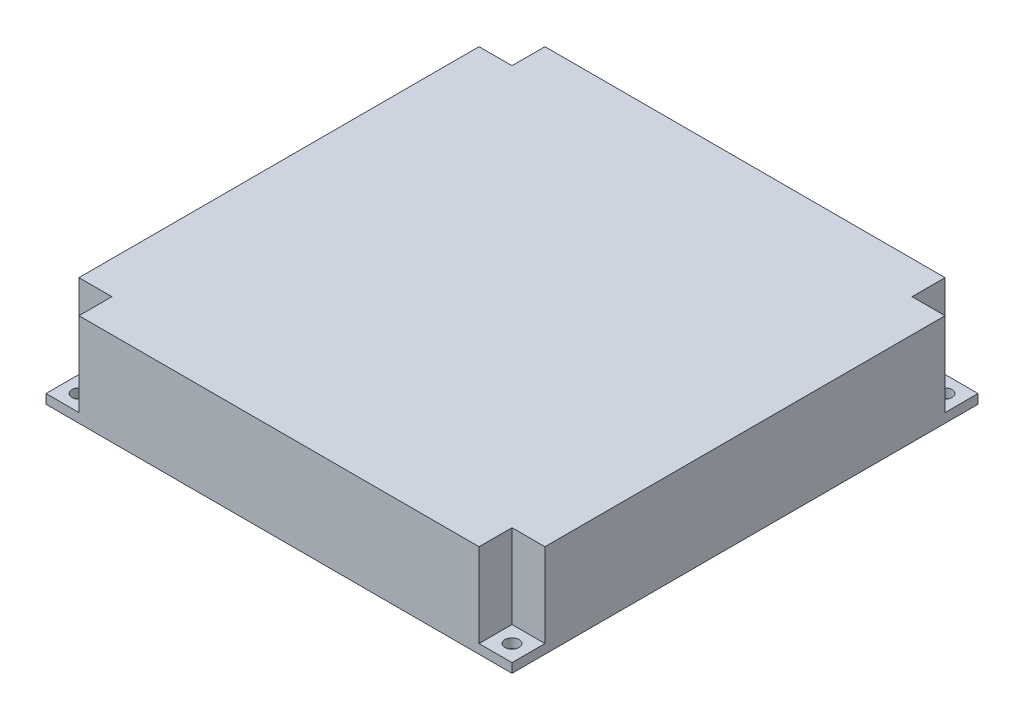
ISO-10303-21;
HEADER;
FILE_DESCRIPTION(('STEP AP214'),'2;1');
FILE_NAME('part.step','',(''),(''),'','','');
FILE_SCHEMA(('AUTOMOTIVE_DESIGN { 1 0 10303 214 1 1 1 1 }'));
ENDSEC;
DATA;
#1=APPLICATION_CONTEXT('core data for automotive mechanical design processes');
#2=APPLICATION_PROTOCOL_DEFINITION('international standard','automotive_design',2000,#1);
#3=PRODUCT_CONTEXT('',#1,'mechanical');
#4=PRODUCT('Part','Part','',(#3));
#5=PRODUCT_RELATED_PRODUCT_CATEGORY('part','',(#4));
#6=PRODUCT_DEFINITION_FORMATION('','',#4);
#7=PRODUCT_DEFINITION_CONTEXT('part definition',#1,'design');
#8=PRODUCT_DEFINITION('design','',#6,#7);
#9=PRODUCT_DEFINITION_SHAPE('','',#8);
#10=(LENGTH_UNIT() NAMED_UNIT(*) SI_UNIT(.MILLI.,.METRE.));
#11=(NAMED_UNIT(*) PLANE_ANGLE_UNIT() SI_UNIT($,.RADIAN.));
#12=(NAMED_UNIT(*) SI_UNIT($,.STERADIAN.) SOLID_ANGLE_UNIT());
#13=UNCERTAINTY_MEASURE_WITH_UNIT(LENGTH_MEASURE(1.E-05),#10,'distance_accuracy_value','');
#14=(GEOMETRIC_REPRESENTATION_CONTEXT(3) GLOBAL_UNCERTAINTY_ASSIGNED_CONTEXT((#13)) GLOBAL_UNIT_ASSIGNED_CONTEXT((#10,
#11,#12)) REPRESENTATION_CONTEXT('',''));
#15=CARTESIAN_POINT('',(0.,0.,0.));
#16=DIRECTION('',(0.,0.,1.));
#17=DIRECTION('',(1.,0.,0.));
#18=AXIS2_PLACEMENT_3D('',#15,#16,#17);
#19=CARTESIAN_POINT('',(-46.4644660940671,-8.,-46.4644660940674));
#20=DIRECTION('',(0.,1.,0.));
#21=DIRECTION('',(0.,0.,1.));
#22=AXIS2_PLACEMENT_3D('',#19,#20,#21);
#23=CYLINDRICAL_SURFACE('',#22,1.5);
#24=CARTESIAN_POINT('',(-46.4644660940671,0.,-46.4644660940674));
#25=DIRECTION('',(0.,1.,0.));
#26=DIRECTION('',(0.,0.,1.));
#27=AXIS2_PLACEMENT_3D('',#24,#25,#26);
#28=CIRCLE('',#27,1.5);
#29=CARTESIAN_POINT('',(-46.4644660940671,0.,-44.9644660940674));
#30=VERTEX_POINT('',#29);
#31=EDGE_CURVE('E391',#30,#30,#28,.T.);
#32=ORIENTED_EDGE('',*,*,#31,.F.);
#33=EDGE_LOOP('',(#32));
#34=FACE_BOUND('',#33,.T.);
#35=CARTESIAN_POINT('',(-46.4644660940671,2.,-46.4644660940674));
#36=DIRECTION('',(0.,1.,0.));
#37=DIRECTION('',(0.,0.,1.));
#38=AXIS2_PLACEMENT_3D('',#35,#36,#37);
#39=CIRCLE('',#38,1.5);
#40=CARTESIAN_POINT('',(-46.4644660940671,2.,-44.9644660940674));
#41=VERTEX_POINT('',#40);
#42=EDGE_CURVE('E403',#41,#41,#39,.F.);
#43=ORIENTED_EDGE('',*,*,#42,.F.);
#44=EDGE_LOOP('',(#43));
#45=FACE_BOUND('',#44,.T.);
#46=ADVANCED_FACE('F42',(#34,#45),#23,.F.);
#47=CARTESIAN_POINT('',(46.4644660940676,-8.,-46.4644660940669));
#48=DIRECTION('',(0.,1.,0.));
#49=DIRECTION('',(0.,0.,1.));
#50=AXIS2_PLACEMENT_3D('',#47,#48,#49);
#51=CYLINDRICAL_SURFACE('',#50,1.50000000000001);
#52=CARTESIAN_POINT('',(46.4644660940676,0.,-46.4644660940669));
#53=DIRECTION('',(0.,1.,0.));
#54=DIRECTION('',(0.,0.,1.));
#55=AXIS2_PLACEMENT_3D('',#52,#53,#54);
#56=CIRCLE('',#55,1.50000000000001);
#57=CARTESIAN_POINT('',(46.4644660940676,0.,-44.9644660940669));
#58=VERTEX_POINT('',#57);
#59=EDGE_CURVE('E394',#58,#58,#56,.T.);
#60=ORIENTED_EDGE('',*,*,#59,.F.);
#61=EDGE_LOOP('',(#60));
#62=FACE_BOUND('',#61,.T.);
#63=CARTESIAN_POINT('',(46.4644660940676,2.,-46.4644660940669));
#64=DIRECTION('',(0.,1.,0.));
#65=DIRECTION('',(0.,0.,1.));
#66=AXIS2_PLACEMENT_3D('',#63,#64,#65);
#67=CIRCLE('',#66,1.50000000000001);
#68=CARTESIAN_POINT('',(46.4644660940676,2.,-44.9644660940669));
#69=VERTEX_POINT('',#68);
#70=EDGE_CURVE('E401',#69,#69,#67,.F.);
#71=ORIENTED_EDGE('',*,*,#70,.F.);
#72=EDGE_LOOP('',(#71));
#73=FACE_BOUND('',#72,.T.);
#74=ADVANCED_FACE('F431',(#62,#73),#51,.F.);
#75=CARTESIAN_POINT('',(46.4644660940668,-8.,46.4644660940677));
#76=DIRECTION('',(0.,1.,0.));
#77=DIRECTION('',(0.,0.,1.));
#78=AXIS2_PLACEMENT_3D('',#75,#76,#77);
#79=CYLINDRICAL_SURFACE('',#78,1.50000000000001);
#80=CARTESIAN_POINT('',(46.4644660940668,0.,46.4644660940677));
#81=DIRECTION('',(0.,1.,0.));
#82=DIRECTION('',(0.,0.,1.));
#83=AXIS2_PLACEMENT_3D('',#80,#81,#82);
#84=CIRCLE('',#83,1.50000000000001);
#85=CARTESIAN_POINT('',(46.4644660940668,0.,47.9644660940677));
#86=VERTEX_POINT('',#85);
#87=EDGE_CURVE('E376',#86,#86,#84,.T.);
#88=ORIENTED_EDGE('',*,*,#87,.F.);
#89=EDGE_LOOP('',(#88));
#90=FACE_BOUND('',#89,.T.);
#91=CARTESIAN_POINT('',(46.4644660940668,2.,46.4644660940677));
#92=DIRECTION('',(0.,1.,0.));
#93=DIRECTION('',(0.,0.,1.));
#94=AXIS2_PLACEMENT_3D('',#91,#92,#93);
#95=CIRCLE('',#94,1.50000000000001);
#96=CARTESIAN_POINT('',(46.4644660940668,2.,47.9644660940677));
#97=VERTEX_POINT('',#96);
#98=EDGE_CURVE('E354',#97,#97,#95,.F.);
#99=ORIENTED_EDGE('',*,*,#98,.F.);
#100=EDGE_LOOP('',(#99));
#101=FACE_BOUND('',#100,.T.);
#102=ADVANCED_FACE('F437',(#90,#101),#79,.F.);
#103=CARTESIAN_POINT('',(50.,20.,-50.));
#104=DIRECTION('',(-1.,0.,0.));
#105=DIRECTION('',(0.,0.,1.));
#106=AXIS2_PLACEMENT_3D('',#103,#104,#105);
#107=PLANE('',#106);
#108=DIRECTION('',(0.,0.,-1.));
#109=VECTOR('',#108,1.);
#110=CARTESIAN_POINT('',(50.,20.,-50.));
#111=LINE('',#110,#109);
#112=CARTESIAN_POINT('',(50.,20.,42.928932188135));
#113=VERTEX_POINT('',#112);
#114=CARTESIAN_POINT('',(50.0000000000003,20.,-42.9289321881342));
#115=VERTEX_POINT('',#114);
#116=EDGE_CURVE('E358',#113,#115,#111,.T.);
#117=ORIENTED_EDGE('',*,*,#116,.F.);
#118=DIRECTION('',(0.,1.,0.));
#119=VECTOR('',#118,1.);
#120=CARTESIAN_POINT('',(49.9999999999996,2.,42.928932188135));
#121=LINE('',#120,#119);
#122=CARTESIAN_POINT('',(49.9999999999996,2.,42.928932188135));
#123=VERTEX_POINT('',#122);
#124=EDGE_CURVE('E316',#123,#113,#121,.T.);
#125=ORIENTED_EDGE('',*,*,#124,.F.);
#126=DIRECTION('',(0.,0.,-1.));
#127=VECTOR('',#126,1.);
#128=CARTESIAN_POINT('',(49.9999999999996,2.,42.928932188135));
#129=LINE('',#128,#127);
#130=CARTESIAN_POINT('',(49.9999999999995,2.,50.0000000000005));
#131=VERTEX_POINT('',#130);
#132=EDGE_CURVE('E325',#131,#123,#129,.T.);
#133=ORIENTED_EDGE('',*,*,#132,.F.);
#134=DIRECTION('',(0.,-1.,0.));
#135=VECTOR('',#134,1.);
#136=CARTESIAN_POINT('',(50.,20.,50.));
#137=LINE('',#136,#135);
#138=CARTESIAN_POINT('',(50.,0.,50.));
#139=VERTEX_POINT('',#138);
#140=EDGE_CURVE('E371',#131,#139,#137,.T.);
#141=ORIENTED_EDGE('',*,*,#140,.T.);
#142=DIRECTION('',(0.,0.,-1.));
#143=VECTOR('',#142,1.);
#144=CARTESIAN_POINT('',(50.,0.,-50.));
#145=LINE('',#144,#143);
#146=CARTESIAN_POINT('',(50.,0.,-50.));
#147=VERTEX_POINT('',#146);
#148=EDGE_CURVE('E372',#139,#147,#145,.T.);
#149=ORIENTED_EDGE('',*,*,#148,.T.);
#150=DIRECTION('',(0.,-1.,0.));
#151=VECTOR('',#150,1.);
#152=CARTESIAN_POINT('',(50.,20.,-50.));
#153=LINE('',#152,#151);
#154=CARTESIAN_POINT('',(50.0000000000003,2.,-49.9999999999997));
#155=VERTEX_POINT('',#154);
#156=EDGE_CURVE('E11',#155,#147,#153,.T.);
#157=ORIENTED_EDGE('',*,*,#156,.F.);
#158=DIRECTION('',(0.,0.,-1.));
#159=VECTOR('',#158,1.);
#160=CARTESIAN_POINT('',(50.0000000000003,2.,-42.9289321881342));
#161=LINE('',#160,#159);
#162=CARTESIAN_POINT('',(50.0000000000003,2.,-42.9289321881342));
#163=VERTEX_POINT('',#162);
#164=EDGE_CURVE('E295',#163,#155,#161,.T.);
#165=ORIENTED_EDGE('',*,*,#164,.F.);
#166=DIRECTION('',(0.,1.,0.));
#167=VECTOR('',#166,1.);
#168=CARTESIAN_POINT('',(50.0000000000003,2.,-42.9289321881342));
#169=LINE('',#168,#167);
#170=EDGE_CURVE('E298',#163,#115,#169,.T.);
#171=ORIENTED_EDGE('',*,*,#170,.T.);
#172=EDGE_LOOP('',(#117,#125,#133,#141,#149,#157,#165,#171));
#173=FACE_BOUND('',#172,.T.);
#174=ADVANCED_FACE('F44',(#173),#107,.F.);
#175=CARTESIAN_POINT('',(-50.,20.,-50.));
#176=DIRECTION('',(0.,0.,1.));
#177=DIRECTION('',(1.,0.,0.));
#178=AXIS2_PLACEMENT_3D('',#175,#176,#177);
#179=PLANE('',#178);
#180=DIRECTION('',(-1.,0.,0.));
#181=VECTOR('',#180,1.);
#182=CARTESIAN_POINT('',(-50.,20.,-50.));
#183=LINE('',#182,#181);
#184=CARTESIAN_POINT('',(42.9289321881348,20.,-50.));
#185=VERTEX_POINT('',#184);
#186=CARTESIAN_POINT('',(-42.9289321881344,20.,-50.0000000000001));
#187=VERTEX_POINT('',#186);
#188=EDGE_CURVE('E361',#185,#187,#183,.T.);
#189=ORIENTED_EDGE('',*,*,#188,.F.);
#190=DIRECTION('',(0.,1.,0.));
#191=VECTOR('',#190,1.);
#192=CARTESIAN_POINT('',(42.9289321881348,2.,-49.9999999999997));
#193=LINE('',#192,#191);
#194=CARTESIAN_POINT('',(42.9289321881348,2.,-49.9999999999997));
#195=VERTEX_POINT('',#194);
#196=EDGE_CURVE('E293',#195,#185,#193,.T.);
#197=ORIENTED_EDGE('',*,*,#196,.F.);
#198=DIRECTION('',(-1.,0.,0.));
#199=VECTOR('',#198,1.);
#200=CARTESIAN_POINT('',(42.9289321881348,2.,-49.9999999999997));
#201=LINE('',#200,#199);
#202=EDGE_CURVE('E304',#155,#195,#201,.T.);
#203=ORIENTED_EDGE('',*,*,#202,.F.);
#204=ORIENTED_EDGE('',*,*,#156,.T.);
#205=DIRECTION('',(-1.,0.,0.));
#206=VECTOR('',#205,1.);
#207=CARTESIAN_POINT('',(-50.,0.,-50.));
#208=LINE('',#207,#206);
#209=CARTESIAN_POINT('',(-50.,0.,-50.));
#210=VERTEX_POINT('',#209);
#211=EDGE_CURVE('E375',#147,#210,#208,.T.);
#212=ORIENTED_EDGE('',*,*,#211,.T.);
#213=DIRECTION('',(0.,-1.,0.));
#214=VECTOR('',#213,1.);
#215=CARTESIAN_POINT('',(-50.,20.,-50.));
#216=LINE('',#215,#214);
#217=CARTESIAN_POINT('',(-49.9999999999999,2.,-50.0000000000002));
#218=VERTEX_POINT('',#217);
#219=EDGE_CURVE('E51',#218,#210,#216,.T.);
#220=ORIENTED_EDGE('',*,*,#219,.F.);
#221=DIRECTION('',(-1.,0.,0.));
#222=VECTOR('',#221,1.);
#223=CARTESIAN_POINT('',(-42.9289321881344,2.,-50.0000000000001));
#224=LINE('',#223,#222);
#225=CARTESIAN_POINT('',(-42.9289321881344,2.,-50.0000000000001));
#226=VERTEX_POINT('',#225);
#227=EDGE_CURVE('E270',#226,#218,#224,.T.);
#228=ORIENTED_EDGE('',*,*,#227,.F.);
#229=DIRECTION('',(0.,1.,0.));
#230=VECTOR('',#229,1.);
#231=CARTESIAN_POINT('',(-42.9289321881344,2.,-50.0000000000001));
#232=LINE('',#231,#230);
#233=EDGE_CURVE('E273',#226,#187,#232,.T.);
#234=ORIENTED_EDGE('',*,*,#233,.T.);
#235=EDGE_LOOP('',(#189,#197,#203,#204,#212,#220,#228,#234));
#236=FACE_BOUND('',#235,.T.);
#237=ADVANCED_FACE('F462',(#236),#179,.F.);
#238=CARTESIAN_POINT('',(-50.,20.,-50.));
#239=DIRECTION('',(1.,0.,0.));
#240=DIRECTION('',(0.,0.,-1.));
#241=AXIS2_PLACEMENT_3D('',#238,#239,#240);
#242=PLANE('',#241);
#243=DIRECTION('',(0.,0.,1.));
#244=VECTOR('',#243,1.);
#245=CARTESIAN_POINT('',(-50.,20.,-50.));
#246=LINE('',#245,#244);
#247=CARTESIAN_POINT('',(-50.,20.,-42.9289321881347));
#248=VERTEX_POINT('',#247);
#249=CARTESIAN_POINT('',(-50.,20.,42.9289321881345));
#250=VERTEX_POINT('',#249);
#251=EDGE_CURVE('E365',#248,#250,#246,.T.);
#252=ORIENTED_EDGE('',*,*,#251,.F.);
#253=DIRECTION('',(0.,1.,0.));
#254=VECTOR('',#253,1.);
#255=CARTESIAN_POINT('',(-49.9999999999999,2.,-42.9289321881347));
#256=LINE('',#255,#254);
#257=CARTESIAN_POINT('',(-49.9999999999999,2.,-42.9289321881347));
#258=VERTEX_POINT('',#257);
#259=EDGE_CURVE('E268',#258,#248,#256,.T.);
#260=ORIENTED_EDGE('',*,*,#259,.F.);
#261=DIRECTION('',(0.,0.,1.));
#262=VECTOR('',#261,1.);
#263=CARTESIAN_POINT('',(-49.9999999999999,2.,-42.9289321881347));
#264=LINE('',#263,#262);
#265=EDGE_CURVE('E280',#218,#258,#264,.T.);
#266=ORIENTED_EDGE('',*,*,#265,.F.);
#267=ORIENTED_EDGE('',*,*,#219,.T.);
#268=DIRECTION('',(0.,0.,1.));
#269=VECTOR('',#268,1.);
#270=CARTESIAN_POINT('',(-50.,0.,-50.));
#271=LINE('',#270,#269);
#272=CARTESIAN_POINT('',(-50.,0.,50.));
#273=VERTEX_POINT('',#272);
#274=EDGE_CURVE('E379',#210,#273,#271,.T.);
#275=ORIENTED_EDGE('',*,*,#274,.T.);
#276=DIRECTION('',(0.,-1.,0.));
#277=VECTOR('',#276,1.);
#278=CARTESIAN_POINT('',(-50.,20.,50.));
#279=LINE('',#278,#277);
#280=CARTESIAN_POINT('',(-50.,2.,50.));
#281=VERTEX_POINT('',#280);
#282=EDGE_CURVE('E385',#281,#273,#279,.T.);
#283=ORIENTED_EDGE('',*,*,#282,.F.);
#284=DIRECTION('',(0.,0.,1.));
#285=VECTOR('',#284,1.);
#286=CARTESIAN_POINT('',(-50.,2.,42.9289321881345));
#287=LINE('',#286,#285);
#288=CARTESIAN_POINT('',(-50.,2.,42.9289321881345));
#289=VERTEX_POINT('',#288);
#290=EDGE_CURVE('E337',#289,#281,#287,.T.);
#291=ORIENTED_EDGE('',*,*,#290,.F.);
#292=DIRECTION('',(0.,1.,0.));
#293=VECTOR('',#292,1.);
#294=CARTESIAN_POINT('',(-50.,2.,42.9289321881345));
#295=LINE('',#294,#293);
#296=EDGE_CURVE('E351',#289,#250,#295,.T.);
#297=ORIENTED_EDGE('',*,*,#296,.T.);
#298=EDGE_LOOP('',(#252,#260,#266,#267,#275,#283,#291,#297));
#299=FACE_BOUND('',#298,.T.);
#300=ADVANCED_FACE('F459',(#299),#242,.F.);
#301=CARTESIAN_POINT('',(-50.,20.,50.));
#302=DIRECTION('',(0.,0.,-1.));
#303=DIRECTION('',(-1.,0.,0.));
#304=AXIS2_PLACEMENT_3D('',#301,#302,#303);
#305=PLANE('',#304);
#306=DIRECTION('',(1.,0.,0.));
#307=VECTOR('',#306,1.);
#308=CARTESIAN_POINT('',(42.928932188134,2.,50.0000000000004));
#309=LINE('',#308,#307);
#310=CARTESIAN_POINT('',(42.928932188134,2.,50.0000000000004));
#311=VERTEX_POINT('',#310);
#312=EDGE_CURVE('E318',#311,#131,#309,.T.);
#313=ORIENTED_EDGE('',*,*,#312,.F.);
#314=DIRECTION('',(0.,1.,0.));
#315=VECTOR('',#314,1.);
#316=CARTESIAN_POINT('',(42.928932188134,2.,50.0000000000004));
#317=LINE('',#316,#315);
#318=CARTESIAN_POINT('',(42.928932188134,20.,50.0000000000004));
#319=VERTEX_POINT('',#318);
#320=EDGE_CURVE('E267',#311,#319,#317,.T.);
#321=ORIENTED_EDGE('',*,*,#320,.T.);
#322=DIRECTION('',(1.,0.,0.));
#323=VECTOR('',#322,1.);
#324=CARTESIAN_POINT('',(-50.,20.,50.));
#325=LINE('',#324,#323);
#326=CARTESIAN_POINT('',(-42.9289321881345,20.,50.));
#327=VERTEX_POINT('',#326);
#328=EDGE_CURVE('E368',#327,#319,#325,.T.);
#329=ORIENTED_EDGE('',*,*,#328,.F.);
#330=DIRECTION('',(0.,1.,0.));
#331=VECTOR('',#330,1.);
#332=CARTESIAN_POINT('',(-42.9289321881345,2.,50.));
#333=LINE('',#332,#331);
#334=CARTESIAN_POINT('',(-42.9289321881345,2.,50.));
#335=VERTEX_POINT('',#334);
#336=EDGE_CURVE('E67',#335,#327,#333,.T.);
#337=ORIENTED_EDGE('',*,*,#336,.F.);
#338=DIRECTION('',(1.,0.,0.));
#339=VECTOR('',#338,1.);
#340=CARTESIAN_POINT('',(-42.9289321881345,2.,50.));
#341=LINE('',#340,#339);
#342=EDGE_CURVE('E339',#281,#335,#341,.T.);
#343=ORIENTED_EDGE('',*,*,#342,.F.);
#344=ORIENTED_EDGE('',*,*,#282,.T.);
#345=DIRECTION('',(1.,0.,0.));
#346=VECTOR('',#345,1.);
#347=CARTESIAN_POINT('',(-50.,0.,50.));
#348=LINE('',#347,#346);
#349=EDGE_CURVE('E362',#273,#139,#348,.T.);
#350=ORIENTED_EDGE('',*,*,#349,.T.);
#351=ORIENTED_EDGE('',*,*,#140,.F.);
#352=EDGE_LOOP('',(#313,#321,#329,#337,#343,#344,#350,#351));
#353=FACE_BOUND('',#352,.T.);
#354=ADVANCED_FACE('F453',(#353),#305,.F.);
#355=CARTESIAN_POINT('',(0.,20.,0.));
#356=DIRECTION('',(0.,1.,0.));
#357=DIRECTION('',(0.,0.,1.));
#358=AXIS2_PLACEMENT_3D('',#355,#356,#357);
#359=PLANE('',#358);
#360=DIRECTION('',(0.,0.,1.));
#361=VECTOR('',#360,1.);
#362=CARTESIAN_POINT('',(42.9289321881341,20.,42.928932188135));
#363=LINE('',#362,#361);
#364=CARTESIAN_POINT('',(42.9289321881341,20.,42.928932188135));
#365=VERTEX_POINT('',#364);
#366=EDGE_CURVE('E323',#365,#319,#363,.T.);
#367=ORIENTED_EDGE('',*,*,#366,.F.);
#368=DIRECTION('',(-1.,0.,0.));
#369=VECTOR('',#368,1.);
#370=CARTESIAN_POINT('',(42.9289321881341,20.,42.928932188135));
#371=LINE('',#370,#369);
#372=EDGE_CURVE('E301',#113,#365,#371,.T.);
#373=ORIENTED_EDGE('',*,*,#372,.F.);
#374=ORIENTED_EDGE('',*,*,#116,.T.);
#375=DIRECTION('',(1.,0.,0.));
#376=VECTOR('',#375,1.);
#377=CARTESIAN_POINT('',(42.9289321881348,20.,-42.9289321881342));
#378=LINE('',#377,#376);
#379=CARTESIAN_POINT('',(42.9289321881348,20.,-42.9289321881342));
#380=VERTEX_POINT('',#379);
#381=EDGE_CURVE('E302',#380,#115,#378,.T.);
#382=ORIENTED_EDGE('',*,*,#381,.F.);
#383=DIRECTION('',(0.,0.,1.));
#384=VECTOR('',#383,1.);
#385=CARTESIAN_POINT('',(42.9289321881348,20.,-42.9289321881342));
#386=LINE('',#385,#384);
#387=EDGE_CURVE('E276',#185,#380,#386,.T.);
#388=ORIENTED_EDGE('',*,*,#387,.F.);
#389=ORIENTED_EDGE('',*,*,#188,.T.);
#390=DIRECTION('',(0.,0.,-1.));
#391=VECTOR('',#390,1.);
#392=CARTESIAN_POINT('',(-42.9289321881344,20.,-42.9289321881347));
#393=LINE('',#392,#391);
#394=CARTESIAN_POINT('',(-42.9289321881344,20.,-42.9289321881347));
#395=VERTEX_POINT('',#394);
#396=EDGE_CURVE('E277',#395,#187,#393,.T.);
#397=ORIENTED_EDGE('',*,*,#396,.F.);
#398=DIRECTION('',(1.,0.,0.));
#399=VECTOR('',#398,1.);
#400=CARTESIAN_POINT('',(-42.9289321881344,20.,-42.9289321881347));
#401=LINE('',#400,#399);
#402=EDGE_CURVE('E279',#248,#395,#401,.T.);
#403=ORIENTED_EDGE('',*,*,#402,.F.);
#404=ORIENTED_EDGE('',*,*,#251,.T.);
#405=DIRECTION('',(-1.,0.,0.));
#406=VECTOR('',#405,1.);
#407=CARTESIAN_POINT('',(-42.9289321881345,20.,42.9289321881345));
#408=LINE('',#407,#406);
#409=CARTESIAN_POINT('',(-42.9289321881345,20.,42.9289321881345));
#410=VERTEX_POINT('',#409);
#411=EDGE_CURVE('E340',#410,#250,#408,.T.);
#412=ORIENTED_EDGE('',*,*,#411,.F.);
#413=DIRECTION('',(0.,0.,-1.));
#414=VECTOR('',#413,1.);
#415=CARTESIAN_POINT('',(-42.9289321881345,20.,42.9289321881345));
#416=LINE('',#415,#414);
#417=EDGE_CURVE('E283',#327,#410,#416,.T.);
#418=ORIENTED_EDGE('',*,*,#417,.F.);
#419=ORIENTED_EDGE('',*,*,#328,.T.);
#420=EDGE_LOOP('',(#367,#373,#374,#382,#388,#389,#397,#403,#404,#412,#418,#419));
#421=FACE_BOUND('',#420,.T.);
#422=ADVANCED_FACE('F450',(#421),#359,.T.);
#423=CARTESIAN_POINT('',(0.,0.,0.));
#424=DIRECTION('',(0.,1.,0.));
#425=DIRECTION('',(0.,0.,1.));
#426=AXIS2_PLACEMENT_3D('',#423,#424,#425);
#427=PLANE('',#426);
#428=DIRECTION('',(0.,0.,1.));
#429=VECTOR('',#428,1.);
#430=CARTESIAN_POINT('',(40.9289321881345,0.,2.81147158996242E-13));
#431=LINE('',#430,#429);
#432=CARTESIAN_POINT('',(40.9289321881348,0.,-48.));
#433=VERTEX_POINT('',#432);
#434=CARTESIAN_POINT('',(40.9289321881348,0.,-40.9289321881342));
#435=VERTEX_POINT('',#434);
#436=EDGE_CURVE('E259',#433,#435,#431,.T.);
#437=ORIENTED_EDGE('',*,*,#436,.F.);
#438=DIRECTION('',(-1.,0.,0.));
#439=VECTOR('',#438,1.);
#440=CARTESIAN_POINT('',(-50.,0.,-48.));
#441=LINE('',#440,#439);
#442=CARTESIAN_POINT('',(-40.9289321881344,0.,-48.));
#443=VERTEX_POINT('',#442);
#444=EDGE_CURVE('E241',#433,#443,#441,.T.);
#445=ORIENTED_EDGE('',*,*,#444,.T.);
#446=DIRECTION('',(0.,0.,-1.));
#447=VECTOR('',#446,1.);
#448=CARTESIAN_POINT('',(-40.9289321881345,0.,-1.20491639569818E-13));
#449=LINE('',#448,#447);
#450=CARTESIAN_POINT('',(-40.9289321881344,0.,-40.9289321881347));
#451=VERTEX_POINT('',#450);
#452=EDGE_CURVE('E250',#451,#443,#449,.T.);
#453=ORIENTED_EDGE('',*,*,#452,.F.);
#454=DIRECTION('',(1.,0.,0.));
#455=VECTOR('',#454,1.);
#456=CARTESIAN_POINT('',(1.20491639569818E-13,0.,-40.9289321881345));
#457=LINE('',#456,#455);
#458=CARTESIAN_POINT('',(-48.,0.,-40.9289321881347));
#459=VERTEX_POINT('',#458);
#460=EDGE_CURVE('E245',#459,#451,#457,.T.);
#461=ORIENTED_EDGE('',*,*,#460,.F.);
#462=DIRECTION('',(0.,0.,1.));
#463=VECTOR('',#462,1.);
#464=CARTESIAN_POINT('',(-48.,0.,-50.));
#465=LINE('',#464,#463);
#466=CARTESIAN_POINT('',(-48.,0.,40.9289321881345));
#467=VERTEX_POINT('',#466);
#468=EDGE_CURVE('E229',#459,#467,#465,.T.);
#469=ORIENTED_EDGE('',*,*,#468,.T.);
#470=DIRECTION('',(-1.,0.,0.));
#471=VECTOR('',#470,1.);
#472=CARTESIAN_POINT('',(-42.9289321881345,0.,40.9289321881345));
#473=LINE('',#472,#471);
#474=CARTESIAN_POINT('',(-40.9289321881345,0.,40.9289321881345));
#475=VERTEX_POINT('',#474);
#476=EDGE_CURVE('E877',#475,#467,#473,.T.);
#477=ORIENTED_EDGE('',*,*,#476,.F.);
#478=DIRECTION('',(0.,0.,-1.));
#479=VECTOR('',#478,1.);
#480=CARTESIAN_POINT('',(-40.9289321881345,0.,42.9289321881345));
#481=LINE('',#480,#479);
#482=CARTESIAN_POINT('',(-40.9289321881345,0.,48.));
#483=VERTEX_POINT('',#482);
#484=EDGE_CURVE('E880',#483,#475,#481,.T.);
#485=ORIENTED_EDGE('',*,*,#484,.F.);
#486=DIRECTION('',(1.,0.,0.));
#487=VECTOR('',#486,1.);
#488=CARTESIAN_POINT('',(-50.,0.,48.));
#489=LINE('',#488,#487);
#490=CARTESIAN_POINT('',(40.928932188134,0.,48.));
#491=VERTEX_POINT('',#490);
#492=EDGE_CURVE('E240',#483,#491,#489,.T.);
#493=ORIENTED_EDGE('',*,*,#492,.T.);
#494=DIRECTION('',(0.,0.,1.));
#495=VECTOR('',#494,1.);
#496=CARTESIAN_POINT('',(40.9289321881345,0.,4.0163879856606E-13));
#497=LINE('',#496,#495);
#498=CARTESIAN_POINT('',(40.9289321881341,0.,40.9289321881349));
#499=VERTEX_POINT('',#498);
#500=EDGE_CURVE('E904',#499,#491,#497,.T.);
#501=ORIENTED_EDGE('',*,*,#500,.F.);
#502=DIRECTION('',(-1.,0.,0.));
#503=VECTOR('',#502,1.);
#504=CARTESIAN_POINT('',(-4.0163879856606E-13,0.,40.9289321881345));
#505=LINE('',#504,#503);
#506=CARTESIAN_POINT('',(48.,0.,40.928932188135));
#507=VERTEX_POINT('',#506);
#508=EDGE_CURVE('E890',#507,#499,#505,.T.);
#509=ORIENTED_EDGE('',*,*,#508,.F.);
#510=DIRECTION('',(0.,0.,-1.));
#511=VECTOR('',#510,1.);
#512=CARTESIAN_POINT('',(48.,0.,-50.));
#513=LINE('',#512,#511);
#514=CARTESIAN_POINT('',(48.,0.,-40.9289321881342));
#515=VERTEX_POINT('',#514);
#516=EDGE_CURVE('E887',#507,#515,#513,.T.);
#517=ORIENTED_EDGE('',*,*,#516,.T.);
#518=DIRECTION('',(1.,0.,0.));
#519=VECTOR('',#518,1.);
#520=CARTESIAN_POINT('',(2.81147158996242E-13,0.,-40.9289321881345));
#521=LINE('',#520,#519);
#522=EDGE_CURVE('E256',#435,#515,#521,.T.);
#523=ORIENTED_EDGE('',*,*,#522,.F.);
#524=EDGE_LOOP('',(#437,#445,#453,#461,#469,#477,#485,#493,#501,#509,#517,#523));
#525=FACE_BOUND('',#524,.T.);
#526=ORIENTED_EDGE('',*,*,#87,.T.);
#527=EDGE_LOOP('',(#526));
#528=FACE_BOUND('',#527,.T.);
#529=ORIENTED_EDGE('',*,*,#59,.T.);
#530=EDGE_LOOP('',(#529));
#531=FACE_BOUND('',#530,.T.);
#532=ORIENTED_EDGE('',*,*,#31,.T.);
#533=EDGE_LOOP('',(#532));
#534=FACE_BOUND('',#533,.T.);
#535=CARTESIAN_POINT('',(-46.4644660940672,0.,46.4644660940673));
#536=DIRECTION('',(0.,1.,0.));
#537=DIRECTION('',(0.,0.,1.));
#538=AXIS2_PLACEMENT_3D('',#535,#536,#537);
#539=CIRCLE('',#538,1.5);
#540=CARTESIAN_POINT('',(-46.4644660940672,0.,47.9644660940673));
#541=VERTEX_POINT('',#540);
#542=EDGE_CURVE('E388',#541,#541,#539,.T.);
#543=ORIENTED_EDGE('',*,*,#542,.T.);
#544=EDGE_LOOP('',(#543));
#545=FACE_BOUND('',#544,.T.);
#546=ORIENTED_EDGE('',*,*,#148,.F.);
#547=ORIENTED_EDGE('',*,*,#349,.F.);
#548=ORIENTED_EDGE('',*,*,#274,.F.);
#549=ORIENTED_EDGE('',*,*,#211,.F.);
#550=EDGE_LOOP('',(#546,#547,#548,#549));
#551=FACE_BOUND('',#550,.T.);
#552=ADVANCED_FACE('F253',(#525,#528,#531,#534,#545,#551),#427,.F.);
#553=CARTESIAN_POINT('',(-46.4644660940672,-8.,46.4644660940673));
#554=DIRECTION('',(0.,1.,0.));
#555=DIRECTION('',(0.,0.,1.));
#556=AXIS2_PLACEMENT_3D('',#553,#554,#555);
#557=CYLINDRICAL_SURFACE('',#556,1.5);
#558=CARTESIAN_POINT('',(-46.4644660940672,2.,46.4644660940673));
#559=DIRECTION('',(0.,-1.,0.));
#560=DIRECTION('',(0.,0.,-1.));
#561=AXIS2_PLACEMENT_3D('',#558,#559,#560);
#562=CIRCLE('',#561,1.5);
#563=CARTESIAN_POINT('',(-46.4644660940672,2.,44.9644660940673));
#564=VERTEX_POINT('',#563);
#565=EDGE_CURVE('E46',#564,#564,#562,.F.);
#566=ORIENTED_EDGE('',*,*,#565,.T.);
#567=EDGE_LOOP('',(#566));
#568=FACE_BOUND('',#567,.T.);
#569=ORIENTED_EDGE('',*,*,#542,.F.);
#570=EDGE_LOOP('',(#569));
#571=FACE_BOUND('',#570,.T.);
#572=ADVANCED_FACE('F410',(#568,#571),#557,.F.);
#573=CARTESIAN_POINT('',(0.,2.,0.));
#574=DIRECTION('',(0.,1.,0.));
#575=DIRECTION('',(0.,0.,1.));
#576=AXIS2_PLACEMENT_3D('',#573,#574,#575);
#577=PLANE('',#576);
#578=ORIENTED_EDGE('',*,*,#132,.T.);
#579=DIRECTION('',(-1.,0.,0.));
#580=VECTOR('',#579,1.);
#581=CARTESIAN_POINT('',(42.9289321881341,2.,42.928932188135));
#582=LINE('',#581,#580);
#583=CARTESIAN_POINT('',(42.9289321881341,2.,42.928932188135));
#584=VERTEX_POINT('',#583);
#585=EDGE_CURVE('E332',#123,#584,#582,.T.);
#586=ORIENTED_EDGE('',*,*,#585,.T.);
#587=DIRECTION('',(0.,0.,1.));
#588=VECTOR('',#587,1.);
#589=CARTESIAN_POINT('',(42.9289321881341,2.,42.928932188135));
#590=LINE('',#589,#588);
#591=EDGE_CURVE('E329',#584,#311,#590,.T.);
#592=ORIENTED_EDGE('',*,*,#591,.T.);
#593=ORIENTED_EDGE('',*,*,#312,.T.);
#594=EDGE_LOOP('',(#578,#586,#592,#593));
#595=FACE_BOUND('',#594,.T.);
#596=ORIENTED_EDGE('',*,*,#98,.T.);
#597=EDGE_LOOP('',(#596));
#598=FACE_BOUND('',#597,.T.);
#599=ADVANCED_FACE('F449',(#595,#598),#577,.T.);
#600=CARTESIAN_POINT('',(42.9289321881341,2.,42.928932188135));
#601=DIRECTION('',(-1.,0.,0.));
#602=DIRECTION('',(0.,0.,1.));
#603=AXIS2_PLACEMENT_3D('',#600,#601,#602);
#604=PLANE('',#603);
#605=ORIENTED_EDGE('',*,*,#366,.T.);
#606=ORIENTED_EDGE('',*,*,#320,.F.);
#607=ORIENTED_EDGE('',*,*,#591,.F.);
#608=DIRECTION('',(0.,1.,0.));
#609=VECTOR('',#608,1.);
#610=CARTESIAN_POINT('',(42.9289321881341,2.,42.928932188135));
#611=LINE('',#610,#609);
#612=EDGE_CURVE('E319',#584,#365,#611,.T.);
#613=ORIENTED_EDGE('',*,*,#612,.T.);
#614=EDGE_LOOP('',(#605,#606,#607,#613));
#615=FACE_BOUND('',#614,.T.);
#616=ADVANCED_FACE('F512',(#615),#604,.F.);
#617=CARTESIAN_POINT('',(42.9289321881341,2.,42.928932188135));
#618=DIRECTION('',(0.,0.,-1.));
#619=DIRECTION('',(-1.,0.,0.));
#620=AXIS2_PLACEMENT_3D('',#617,#618,#619);
#621=PLANE('',#620);
#622=ORIENTED_EDGE('',*,*,#372,.T.);
#623=ORIENTED_EDGE('',*,*,#612,.F.);
#624=ORIENTED_EDGE('',*,*,#585,.F.);
#625=ORIENTED_EDGE('',*,*,#124,.T.);
#626=EDGE_LOOP('',(#622,#623,#624,#625));
#627=FACE_BOUND('',#626,.T.);
#628=ADVANCED_FACE('F517',(#627),#621,.F.);
#629=CARTESIAN_POINT('',(0.,2.,0.));
#630=DIRECTION('',(0.,1.,0.));
#631=DIRECTION('',(0.,0.,1.));
#632=AXIS2_PLACEMENT_3D('',#629,#630,#631);
#633=PLANE('',#632);
#634=ORIENTED_EDGE('',*,*,#202,.T.);
#635=DIRECTION('',(0.,0.,1.));
#636=VECTOR('',#635,1.);
#637=CARTESIAN_POINT('',(42.9289321881348,2.,-42.9289321881342));
#638=LINE('',#637,#636);
#639=CARTESIAN_POINT('',(42.9289321881348,2.,-42.9289321881342));
#640=VERTEX_POINT('',#639);
#641=EDGE_CURVE('E311',#195,#640,#638,.T.);
#642=ORIENTED_EDGE('',*,*,#641,.T.);
#643=DIRECTION('',(1.,0.,0.));
#644=VECTOR('',#643,1.);
#645=CARTESIAN_POINT('',(42.9289321881348,2.,-42.9289321881342));
#646=LINE('',#645,#644);
#647=EDGE_CURVE('E308',#640,#163,#646,.T.);
#648=ORIENTED_EDGE('',*,*,#647,.T.);
#649=ORIENTED_EDGE('',*,*,#164,.T.);
#650=EDGE_LOOP('',(#634,#642,#648,#649));
#651=FACE_BOUND('',#650,.T.);
#652=ORIENTED_EDGE('',*,*,#70,.T.);
#653=EDGE_LOOP('',(#652));
#654=FACE_BOUND('',#653,.T.);
#655=ADVANCED_FACE('F483',(#651,#654),#633,.T.);
#656=CARTESIAN_POINT('',(42.9289321881348,2.,-42.9289321881342));
#657=DIRECTION('',(0.,0.,1.));
#658=DIRECTION('',(1.,0.,0.));
#659=AXIS2_PLACEMENT_3D('',#656,#657,#658);
#660=PLANE('',#659);
#661=ORIENTED_EDGE('',*,*,#381,.T.);
#662=ORIENTED_EDGE('',*,*,#170,.F.);
#663=ORIENTED_EDGE('',*,*,#647,.F.);
#664=DIRECTION('',(0.,1.,0.));
#665=VECTOR('',#664,1.);
#666=CARTESIAN_POINT('',(42.9289321881348,2.,-42.9289321881342));
#667=LINE('',#666,#665);
#668=EDGE_CURVE('E296',#640,#380,#667,.T.);
#669=ORIENTED_EDGE('',*,*,#668,.T.);
#670=EDGE_LOOP('',(#661,#662,#663,#669));
#671=FACE_BOUND('',#670,.T.);
#672=ADVANCED_FACE('F520',(#671),#660,.F.);
#673=CARTESIAN_POINT('',(42.9289321881348,2.,-42.9289321881342));
#674=DIRECTION('',(-1.,0.,0.));
#675=DIRECTION('',(0.,0.,1.));
#676=AXIS2_PLACEMENT_3D('',#673,#674,#675);
#677=PLANE('',#676);
#678=ORIENTED_EDGE('',*,*,#387,.T.);
#679=ORIENTED_EDGE('',*,*,#668,.F.);
#680=ORIENTED_EDGE('',*,*,#641,.F.);
#681=ORIENTED_EDGE('',*,*,#196,.T.);
#682=EDGE_LOOP('',(#678,#679,#680,#681));
#683=FACE_BOUND('',#682,.T.);
#684=ADVANCED_FACE('F480',(#683),#677,.F.);
#685=CARTESIAN_POINT('',(0.,2.,0.));
#686=DIRECTION('',(0.,1.,0.));
#687=DIRECTION('',(0.,0.,1.));
#688=AXIS2_PLACEMENT_3D('',#685,#686,#687);
#689=PLANE('',#688);
#690=ORIENTED_EDGE('',*,*,#265,.T.);
#691=DIRECTION('',(1.,0.,0.));
#692=VECTOR('',#691,1.);
#693=CARTESIAN_POINT('',(-42.9289321881344,2.,-42.9289321881347));
#694=LINE('',#693,#692);
#695=CARTESIAN_POINT('',(-42.9289321881344,2.,-42.9289321881347));
#696=VERTEX_POINT('',#695);
#697=EDGE_CURVE('E288',#258,#696,#694,.T.);
#698=ORIENTED_EDGE('',*,*,#697,.T.);
#699=DIRECTION('',(0.,0.,-1.));
#700=VECTOR('',#699,1.);
#701=CARTESIAN_POINT('',(-42.9289321881344,2.,-42.9289321881347));
#702=LINE('',#701,#700);
#703=EDGE_CURVE('E285',#696,#226,#702,.T.);
#704=ORIENTED_EDGE('',*,*,#703,.T.);
#705=ORIENTED_EDGE('',*,*,#227,.T.);
#706=EDGE_LOOP('',(#690,#698,#704,#705));
#707=FACE_BOUND('',#706,.T.);
#708=ORIENTED_EDGE('',*,*,#42,.T.);
#709=EDGE_LOOP('',(#708));
#710=FACE_BOUND('',#709,.T.);
#711=ADVANCED_FACE('F501',(#707,#710),#689,.T.);
#712=CARTESIAN_POINT('',(-42.9289321881344,2.,-42.9289321881347));
#713=DIRECTION('',(1.,0.,0.));
#714=DIRECTION('',(0.,0.,-1.));
#715=AXIS2_PLACEMENT_3D('',#712,#713,#714);
#716=PLANE('',#715);
#717=ORIENTED_EDGE('',*,*,#396,.T.);
#718=ORIENTED_EDGE('',*,*,#233,.F.);
#719=ORIENTED_EDGE('',*,*,#703,.F.);
#720=DIRECTION('',(0.,1.,0.));
#721=VECTOR('',#720,1.);
#722=CARTESIAN_POINT('',(-42.9289321881344,2.,-42.9289321881347));
#723=LINE('',#722,#721);
#724=EDGE_CURVE('E271',#696,#395,#723,.T.);
#725=ORIENTED_EDGE('',*,*,#724,.T.);
#726=EDGE_LOOP('',(#717,#718,#719,#725));
#727=FACE_BOUND('',#726,.T.);
#728=ADVANCED_FACE('F426',(#727),#716,.F.);
#729=CARTESIAN_POINT('',(-42.9289321881344,2.,-42.9289321881347));
#730=DIRECTION('',(0.,0.,1.));
#731=DIRECTION('',(1.,0.,0.));
#732=AXIS2_PLACEMENT_3D('',#729,#730,#731);
#733=PLANE('',#732);
#734=ORIENTED_EDGE('',*,*,#402,.T.);
#735=ORIENTED_EDGE('',*,*,#724,.F.);
#736=ORIENTED_EDGE('',*,*,#697,.F.);
#737=ORIENTED_EDGE('',*,*,#259,.T.);
#738=EDGE_LOOP('',(#734,#735,#736,#737));
#739=FACE_BOUND('',#738,.T.);
#740=ADVANCED_FACE('F416',(#739),#733,.F.);
#741=CARTESIAN_POINT('',(0.,2.,0.));
#742=DIRECTION('',(0.,-1.,0.));
#743=DIRECTION('',(0.,0.,-1.));
#744=AXIS2_PLACEMENT_3D('',#741,#742,#743);
#745=PLANE('',#744);
#746=ORIENTED_EDGE('',*,*,#290,.T.);
#747=ORIENTED_EDGE('',*,*,#342,.T.);
#748=DIRECTION('',(0.,0.,-1.));
#749=VECTOR('',#748,1.);
#750=CARTESIAN_POINT('',(-42.9289321881345,2.,42.9289321881345));
#751=LINE('',#750,#749);
#752=CARTESIAN_POINT('',(-42.9289321881345,2.,42.9289321881345));
#753=VERTEX_POINT('',#752);
#754=EDGE_CURVE('E343',#335,#753,#751,.T.);
#755=ORIENTED_EDGE('',*,*,#754,.T.);
#756=DIRECTION('',(-1.,0.,0.));
#757=VECTOR('',#756,1.);
#758=CARTESIAN_POINT('',(-42.9289321881345,2.,42.9289321881345));
#759=LINE('',#758,#757);
#760=EDGE_CURVE('E346',#753,#289,#759,.T.);
#761=ORIENTED_EDGE('',*,*,#760,.T.);
#762=EDGE_LOOP('',(#746,#747,#755,#761));
#763=FACE_BOUND('',#762,.T.);
#764=ORIENTED_EDGE('',*,*,#565,.F.);
#765=EDGE_LOOP('',(#764));
#766=FACE_BOUND('',#765,.T.);
#767=ADVANCED_FACE('F413',(#763,#766),#745,.F.);
#768=CARTESIAN_POINT('',(-42.9289321881345,2.,42.9289321881345));
#769=DIRECTION('',(0.,0.,-1.));
#770=DIRECTION('',(-1.,0.,0.));
#771=AXIS2_PLACEMENT_3D('',#768,#769,#770);
#772=PLANE('',#771);
#773=ORIENTED_EDGE('',*,*,#411,.T.);
#774=ORIENTED_EDGE('',*,*,#296,.F.);
#775=ORIENTED_EDGE('',*,*,#760,.F.);
#776=DIRECTION('',(0.,1.,0.));
#777=VECTOR('',#776,1.);
#778=CARTESIAN_POINT('',(-42.9289321881345,2.,42.9289321881345));
#779=LINE('',#778,#777);
#780=EDGE_CURVE('E355',#753,#410,#779,.T.);
#781=ORIENTED_EDGE('',*,*,#780,.T.);
#782=EDGE_LOOP('',(#773,#774,#775,#781));
#783=FACE_BOUND('',#782,.T.);
#784=ADVANCED_FACE('F415',(#783),#772,.F.);
#785=CARTESIAN_POINT('',(-42.9289321881345,2.,42.9289321881345));
#786=DIRECTION('',(1.,0.,0.));
#787=DIRECTION('',(0.,0.,-1.));
#788=AXIS2_PLACEMENT_3D('',#785,#786,#787);
#789=PLANE('',#788);
#790=ORIENTED_EDGE('',*,*,#417,.T.);
#791=ORIENTED_EDGE('',*,*,#780,.F.);
#792=ORIENTED_EDGE('',*,*,#754,.F.);
#793=ORIENTED_EDGE('',*,*,#336,.T.);
#794=EDGE_LOOP('',(#790,#791,#792,#793));
#795=FACE_BOUND('',#794,.T.);
#796=ADVANCED_FACE('F423',(#795),#789,.F.);
#797=CARTESIAN_POINT('',(48.,20.,-50.));
#798=DIRECTION('',(-1.,0.,0.));
#799=DIRECTION('',(0.,0.,1.));
#800=AXIS2_PLACEMENT_3D('',#797,#798,#799);
#801=PLANE('',#800);
#802=DIRECTION('',(0.,0.,-1.));
#803=VECTOR('',#802,1.);
#804=CARTESIAN_POINT('',(48.,18.,-50.));
#805=LINE('',#804,#803);
#806=CARTESIAN_POINT('',(48.,18.,40.928932188135));
#807=VERTEX_POINT('',#806);
#808=CARTESIAN_POINT('',(48.,18.,-40.9289321881342));
#809=VERTEX_POINT('',#808);
#810=EDGE_CURVE('E916',#807,#809,#805,.T.);
#811=ORIENTED_EDGE('',*,*,#810,.T.);
#812=DIRECTION('',(0.,1.,0.));
#813=VECTOR('',#812,1.);
#814=CARTESIAN_POINT('',(48.,20.,-40.9289321881342));
#815=LINE('',#814,#813);
#816=EDGE_CURVE('E892',#515,#809,#815,.T.);
#817=ORIENTED_EDGE('',*,*,#816,.F.);
#818=ORIENTED_EDGE('',*,*,#516,.F.);
#819=DIRECTION('',(0.,1.,0.));
#820=VECTOR('',#819,1.);
#821=CARTESIAN_POINT('',(48.,2.,40.928932188135));
#822=LINE('',#821,#820);
#823=EDGE_CURVE('E906',#507,#807,#822,.T.);
#824=ORIENTED_EDGE('',*,*,#823,.T.);
#825=EDGE_LOOP('',(#811,#817,#818,#824));
#826=FACE_BOUND('',#825,.T.);
#827=ADVANCED_FACE('F609',(#826),#801,.T.);
#828=CARTESIAN_POINT('',(-50.,20.,-48.));
#829=DIRECTION('',(0.,0.,1.));
#830=DIRECTION('',(1.,0.,0.));
#831=AXIS2_PLACEMENT_3D('',#828,#829,#830);
#832=PLANE('',#831);
#833=DIRECTION('',(-1.,0.,0.));
#834=VECTOR('',#833,1.);
#835=CARTESIAN_POINT('',(-50.,18.,-48.));
#836=LINE('',#835,#834);
#837=CARTESIAN_POINT('',(40.9289321881348,18.,-48.));
#838=VERTEX_POINT('',#837);
#839=CARTESIAN_POINT('',(-40.9289321881344,18.,-48.));
#840=VERTEX_POINT('',#839);
#841=EDGE_CURVE('E884',#838,#840,#836,.T.);
#842=ORIENTED_EDGE('',*,*,#841,.T.);
#843=DIRECTION('',(0.,1.,0.));
#844=VECTOR('',#843,1.);
#845=CARTESIAN_POINT('',(-40.9289321881344,20.,-48.));
#846=LINE('',#845,#844);
#847=EDGE_CURVE('E899',#443,#840,#846,.T.);
#848=ORIENTED_EDGE('',*,*,#847,.F.);
#849=ORIENTED_EDGE('',*,*,#444,.F.);
#850=DIRECTION('',(0.,1.,0.));
#851=VECTOR('',#850,1.);
#852=CARTESIAN_POINT('',(40.9289321881348,2.,-48.));
#853=LINE('',#852,#851);
#854=EDGE_CURVE('E896',#433,#838,#853,.T.);
#855=ORIENTED_EDGE('',*,*,#854,.T.);
#856=EDGE_LOOP('',(#842,#848,#849,#855));
#857=FACE_BOUND('',#856,.T.);
#858=ADVANCED_FACE('F627',(#857),#832,.T.);
#859=CARTESIAN_POINT('',(-48.,20.,-50.));
#860=DIRECTION('',(1.,0.,0.));
#861=DIRECTION('',(0.,0.,-1.));
#862=AXIS2_PLACEMENT_3D('',#859,#860,#861);
#863=PLANE('',#862);
#864=DIRECTION('',(0.,0.,1.));
#865=VECTOR('',#864,1.);
#866=CARTESIAN_POINT('',(-48.,18.,-50.));
#867=LINE('',#866,#865);
#868=CARTESIAN_POINT('',(-48.,18.,-40.9289321881347));
#869=VERTEX_POINT('',#868);
#870=CARTESIAN_POINT('',(-48.,18.,40.9289321881345));
#871=VERTEX_POINT('',#870);
#872=EDGE_CURVE('E262',#869,#871,#867,.T.);
#873=ORIENTED_EDGE('',*,*,#872,.T.);
#874=DIRECTION('',(0.,1.,0.));
#875=VECTOR('',#874,1.);
#876=CARTESIAN_POINT('',(-48.,20.,40.9289321881345));
#877=LINE('',#876,#875);
#878=EDGE_CURVE('E236',#467,#871,#877,.T.);
#879=ORIENTED_EDGE('',*,*,#878,.F.);
#880=ORIENTED_EDGE('',*,*,#468,.F.);
#881=DIRECTION('',(0.,1.,0.));
#882=VECTOR('',#881,1.);
#883=CARTESIAN_POINT('',(-48.,2.,-40.9289321881347));
#884=LINE('',#883,#882);
#885=EDGE_CURVE('E233',#459,#869,#884,.T.);
#886=ORIENTED_EDGE('',*,*,#885,.T.);
#887=EDGE_LOOP('',(#873,#879,#880,#886));
#888=FACE_BOUND('',#887,.T.);
#889=ADVANCED_FACE('F232',(#888),#863,.T.);
#890=CARTESIAN_POINT('',(-50.,20.,48.));
#891=DIRECTION('',(0.,0.,-1.));
#892=DIRECTION('',(-1.,0.,0.));
#893=AXIS2_PLACEMENT_3D('',#890,#891,#892);
#894=PLANE('',#893);
#895=ORIENTED_EDGE('',*,*,#492,.F.);
#896=DIRECTION('',(0.,1.,0.));
#897=VECTOR('',#896,1.);
#898=CARTESIAN_POINT('',(-40.9289321881345,2.,48.));
#899=LINE('',#898,#897);
#900=CARTESIAN_POINT('',(-40.9289321881345,18.,48.));
#901=VERTEX_POINT('',#900);
#902=EDGE_CURVE('E863',#483,#901,#899,.T.);
#903=ORIENTED_EDGE('',*,*,#902,.T.);
#904=DIRECTION('',(1.,0.,0.));
#905=VECTOR('',#904,1.);
#906=CARTESIAN_POINT('',(-50.,18.,48.));
#907=LINE('',#906,#905);
#908=CARTESIAN_POINT('',(40.928932188134,18.,48.));
#909=VERTEX_POINT('',#908);
#910=EDGE_CURVE('E257',#901,#909,#907,.T.);
#911=ORIENTED_EDGE('',*,*,#910,.T.);
#912=DIRECTION('',(0.,1.,0.));
#913=VECTOR('',#912,1.);
#914=CARTESIAN_POINT('',(40.928932188134,20.,48.));
#915=LINE('',#914,#913);
#916=EDGE_CURVE('E875',#491,#909,#915,.T.);
#917=ORIENTED_EDGE('',*,*,#916,.F.);
#918=EDGE_LOOP('',(#895,#903,#911,#917));
#919=FACE_BOUND('',#918,.T.);
#920=ADVANCED_FACE('F648',(#919),#894,.T.);
#921=CARTESIAN_POINT('',(0.,18.,0.));
#922=DIRECTION('',(0.,1.,0.));
#923=DIRECTION('',(0.,0.,1.));
#924=AXIS2_PLACEMENT_3D('',#921,#922,#923);
#925=PLANE('',#924);
#926=DIRECTION('',(0.,0.,1.));
#927=VECTOR('',#926,1.);
#928=CARTESIAN_POINT('',(40.9289321881345,18.,4.0163879856606E-13));
#929=LINE('',#928,#927);
#930=CARTESIAN_POINT('',(40.9289321881341,18.,40.9289321881349));
#931=VERTEX_POINT('',#930);
#932=EDGE_CURVE('E872',#931,#909,#929,.T.);
#933=ORIENTED_EDGE('',*,*,#932,.T.);
#934=ORIENTED_EDGE('',*,*,#910,.F.);
#935=DIRECTION('',(0.,0.,-1.));
#936=VECTOR('',#935,1.);
#937=CARTESIAN_POINT('',(-40.9289321881345,18.,0.));
#938=LINE('',#937,#936);
#939=CARTESIAN_POINT('',(-40.9289321881345,18.,40.9289321881345));
#940=VERTEX_POINT('',#939);
#941=EDGE_CURVE('E861',#901,#940,#938,.T.);
#942=ORIENTED_EDGE('',*,*,#941,.T.);
#943=DIRECTION('',(-1.,0.,0.));
#944=VECTOR('',#943,1.);
#945=CARTESIAN_POINT('',(0.,18.,40.9289321881345));
#946=LINE('',#945,#944);
#947=EDGE_CURVE('E868',#940,#871,#946,.T.);
#948=ORIENTED_EDGE('',*,*,#947,.T.);
#949=ORIENTED_EDGE('',*,*,#872,.F.);
#950=DIRECTION('',(1.,0.,0.));
#951=VECTOR('',#950,1.);
#952=CARTESIAN_POINT('',(1.20491639569818E-13,18.,-40.9289321881345));
#953=LINE('',#952,#951);
#954=CARTESIAN_POINT('',(-40.9289321881344,18.,-40.9289321881347));
#955=VERTEX_POINT('',#954);
#956=EDGE_CURVE('E248',#869,#955,#953,.T.);
#957=ORIENTED_EDGE('',*,*,#956,.T.);
#958=DIRECTION('',(0.,0.,-1.));
#959=VECTOR('',#958,1.);
#960=CARTESIAN_POINT('',(-40.9289321881345,18.,-1.20491639569818E-13));
#961=LINE('',#960,#959);
#962=EDGE_CURVE('E900',#955,#840,#961,.T.);
#963=ORIENTED_EDGE('',*,*,#962,.T.);
#964=ORIENTED_EDGE('',*,*,#841,.F.);
#965=DIRECTION('',(0.,0.,1.));
#966=VECTOR('',#965,1.);
#967=CARTESIAN_POINT('',(40.9289321881345,18.,2.81147158996242E-13));
#968=LINE('',#967,#966);
#969=CARTESIAN_POINT('',(40.9289321881348,18.,-40.9289321881342));
#970=VERTEX_POINT('',#969);
#971=EDGE_CURVE('E895',#838,#970,#968,.T.);
#972=ORIENTED_EDGE('',*,*,#971,.T.);
#973=DIRECTION('',(1.,0.,0.));
#974=VECTOR('',#973,1.);
#975=CARTESIAN_POINT('',(2.81147158996242E-13,18.,-40.9289321881345));
#976=LINE('',#975,#974);
#977=EDGE_CURVE('E893',#970,#809,#976,.T.);
#978=ORIENTED_EDGE('',*,*,#977,.T.);
#979=ORIENTED_EDGE('',*,*,#810,.F.);
#980=DIRECTION('',(-1.,0.,0.));
#981=VECTOR('',#980,1.);
#982=CARTESIAN_POINT('',(-4.0163879856606E-13,18.,40.9289321881345));
#983=LINE('',#982,#981);
#984=EDGE_CURVE('E889',#807,#931,#983,.T.);
#985=ORIENTED_EDGE('',*,*,#984,.T.);
#986=EDGE_LOOP('',(#933,#934,#942,#948,#949,#957,#963,#964,#972,#978,#979,#985));
#987=FACE_BOUND('',#986,.T.);
#988=ADVANCED_FACE('F658',(#987),#925,.F.);
#989=CARTESIAN_POINT('',(40.9289321881341,2.,42.9289321881349));
#990=DIRECTION('',(-1.,0.,0.));
#991=DIRECTION('',(0.,0.,1.));
#992=AXIS2_PLACEMENT_3D('',#989,#990,#991);
#993=PLANE('',#992);
#994=ORIENTED_EDGE('',*,*,#932,.F.);
#995=DIRECTION('',(0.,1.,0.));
#996=VECTOR('',#995,1.);
#997=CARTESIAN_POINT('',(40.9289321881341,2.,40.9289321881349));
#998=LINE('',#997,#996);
#999=EDGE_CURVE('E907',#499,#931,#998,.T.);
#1000=ORIENTED_EDGE('',*,*,#999,.F.);
#1001=ORIENTED_EDGE('',*,*,#500,.T.);
#1002=ORIENTED_EDGE('',*,*,#916,.T.);
#1003=EDGE_LOOP('',(#994,#1000,#1001,#1002));
#1004=FACE_BOUND('',#1003,.T.);
#1005=ADVANCED_FACE('F669',(#1004),#993,.T.);
#1006=CARTESIAN_POINT('',(42.9289321881341,2.,40.928932188135));
#1007=DIRECTION('',(0.,0.,-1.));
#1008=DIRECTION('',(-1.,0.,0.));
#1009=AXIS2_PLACEMENT_3D('',#1006,#1007,#1008);
#1010=PLANE('',#1009);
#1011=ORIENTED_EDGE('',*,*,#984,.F.);
#1012=ORIENTED_EDGE('',*,*,#823,.F.);
#1013=ORIENTED_EDGE('',*,*,#508,.T.);
#1014=ORIENTED_EDGE('',*,*,#999,.T.);
#1015=EDGE_LOOP('',(#1011,#1012,#1013,#1014));
#1016=FACE_BOUND('',#1015,.T.);
#1017=ADVANCED_FACE('F680',(#1016),#1010,.T.);
#1018=CARTESIAN_POINT('',(42.9289321881348,2.,-40.9289321881342));
#1019=DIRECTION('',(0.,0.,1.));
#1020=DIRECTION('',(1.,0.,0.));
#1021=AXIS2_PLACEMENT_3D('',#1018,#1019,#1020);
#1022=PLANE('',#1021);
#1023=ORIENTED_EDGE('',*,*,#977,.F.);
#1024=DIRECTION('',(0.,1.,0.));
#1025=VECTOR('',#1024,1.);
#1026=CARTESIAN_POINT('',(40.9289321881348,2.,-40.9289321881342));
#1027=LINE('',#1026,#1025);
#1028=EDGE_CURVE('E910',#435,#970,#1027,.T.);
#1029=ORIENTED_EDGE('',*,*,#1028,.F.);
#1030=ORIENTED_EDGE('',*,*,#522,.T.);
#1031=ORIENTED_EDGE('',*,*,#816,.T.);
#1032=EDGE_LOOP('',(#1023,#1029,#1030,#1031));
#1033=FACE_BOUND('',#1032,.T.);
#1034=ADVANCED_FACE('F691',(#1033),#1022,.T.);
#1035=CARTESIAN_POINT('',(40.9289321881348,2.,-42.9289321881342));
#1036=DIRECTION('',(-1.,0.,0.));
#1037=DIRECTION('',(0.,0.,1.));
#1038=AXIS2_PLACEMENT_3D('',#1035,#1036,#1037);
#1039=PLANE('',#1038);
#1040=ORIENTED_EDGE('',*,*,#971,.F.);
#1041=ORIENTED_EDGE('',*,*,#854,.F.);
#1042=ORIENTED_EDGE('',*,*,#436,.T.);
#1043=ORIENTED_EDGE('',*,*,#1028,.T.);
#1044=EDGE_LOOP('',(#1040,#1041,#1042,#1043));
#1045=FACE_BOUND('',#1044,.T.);
#1046=ADVANCED_FACE('F702',(#1045),#1039,.T.);
#1047=CARTESIAN_POINT('',(-40.9289321881344,2.,-42.9289321881347));
#1048=DIRECTION('',(1.,0.,0.));
#1049=DIRECTION('',(0.,0.,-1.));
#1050=AXIS2_PLACEMENT_3D('',#1047,#1048,#1049);
#1051=PLANE('',#1050);
#1052=ORIENTED_EDGE('',*,*,#962,.F.);
#1053=DIRECTION('',(0.,1.,0.));
#1054=VECTOR('',#1053,1.);
#1055=CARTESIAN_POINT('',(-40.9289321881344,2.,-40.9289321881347));
#1056=LINE('',#1055,#1054);
#1057=EDGE_CURVE('E59',#451,#955,#1056,.T.);
#1058=ORIENTED_EDGE('',*,*,#1057,.F.);
#1059=ORIENTED_EDGE('',*,*,#452,.T.);
#1060=ORIENTED_EDGE('',*,*,#847,.T.);
#1061=EDGE_LOOP('',(#1052,#1058,#1059,#1060));
#1062=FACE_BOUND('',#1061,.T.);
#1063=ADVANCED_FACE('F713',(#1062),#1051,.T.);
#1064=CARTESIAN_POINT('',(-42.9289321881344,2.,-40.9289321881347));
#1065=DIRECTION('',(0.,0.,1.));
#1066=DIRECTION('',(1.,0.,0.));
#1067=AXIS2_PLACEMENT_3D('',#1064,#1065,#1066);
#1068=PLANE('',#1067);
#1069=ORIENTED_EDGE('',*,*,#956,.F.);
#1070=ORIENTED_EDGE('',*,*,#885,.F.);
#1071=ORIENTED_EDGE('',*,*,#460,.T.);
#1072=ORIENTED_EDGE('',*,*,#1057,.T.);
#1073=EDGE_LOOP('',(#1069,#1070,#1071,#1072));
#1074=FACE_BOUND('',#1073,.T.);
#1075=ADVANCED_FACE('F244',(#1074),#1068,.T.);
#1076=CARTESIAN_POINT('',(-42.9289321881345,2.,40.9289321881345));
#1077=DIRECTION('',(0.,0.,-1.));
#1078=DIRECTION('',(-1.,0.,0.));
#1079=AXIS2_PLACEMENT_3D('',#1076,#1077,#1078);
#1080=PLANE('',#1079);
#1081=ORIENTED_EDGE('',*,*,#947,.F.);
#1082=DIRECTION('',(0.,1.,0.));
#1083=VECTOR('',#1082,1.);
#1084=CARTESIAN_POINT('',(-40.9289321881345,2.,40.9289321881345));
#1085=LINE('',#1084,#1083);
#1086=EDGE_CURVE('E866',#475,#940,#1085,.T.);
#1087=ORIENTED_EDGE('',*,*,#1086,.F.);
#1088=ORIENTED_EDGE('',*,*,#476,.T.);
#1089=ORIENTED_EDGE('',*,*,#878,.T.);
#1090=EDGE_LOOP('',(#1081,#1087,#1088,#1089));
#1091=FACE_BOUND('',#1090,.T.);
#1092=ADVANCED_FACE('F733',(#1091),#1080,.T.);
#1093=CARTESIAN_POINT('',(-40.9289321881345,2.,42.9289321881345));
#1094=DIRECTION('',(1.,0.,0.));
#1095=DIRECTION('',(0.,0.,-1.));
#1096=AXIS2_PLACEMENT_3D('',#1093,#1094,#1095);
#1097=PLANE('',#1096);
#1098=ORIENTED_EDGE('',*,*,#941,.F.);
#1099=ORIENTED_EDGE('',*,*,#902,.F.);
#1100=ORIENTED_EDGE('',*,*,#484,.T.);
#1101=ORIENTED_EDGE('',*,*,#1086,.T.);
#1102=EDGE_LOOP('',(#1098,#1099,#1100,#1101));
#1103=FACE_BOUND('',#1102,.T.);
#1104=ADVANCED_FACE('F743',(#1103),#1097,.T.);
#1105=CLOSED_SHELL('',(#46,#74,#102,#174,#237,#300,#354,#422,#552,#572,#599,#616,#628,#655,#672,
#684,#711,#728,#740,#767,#784,#796,#827,#858,#889,#920,#988,#1005,#1017,#1034,#1046,#1063,#1075,
#1092,#1104));
#1106=MANIFOLD_SOLID_BREP('B2',#1105);
#1107=ADVANCED_BREP_SHAPE_REPRESENTATION('',(#18,#1106),#14);
#1108=SHAPE_DEFINITION_REPRESENTATION(#9,#1107);
ENDSEC;
END-ISO-10303-21;
